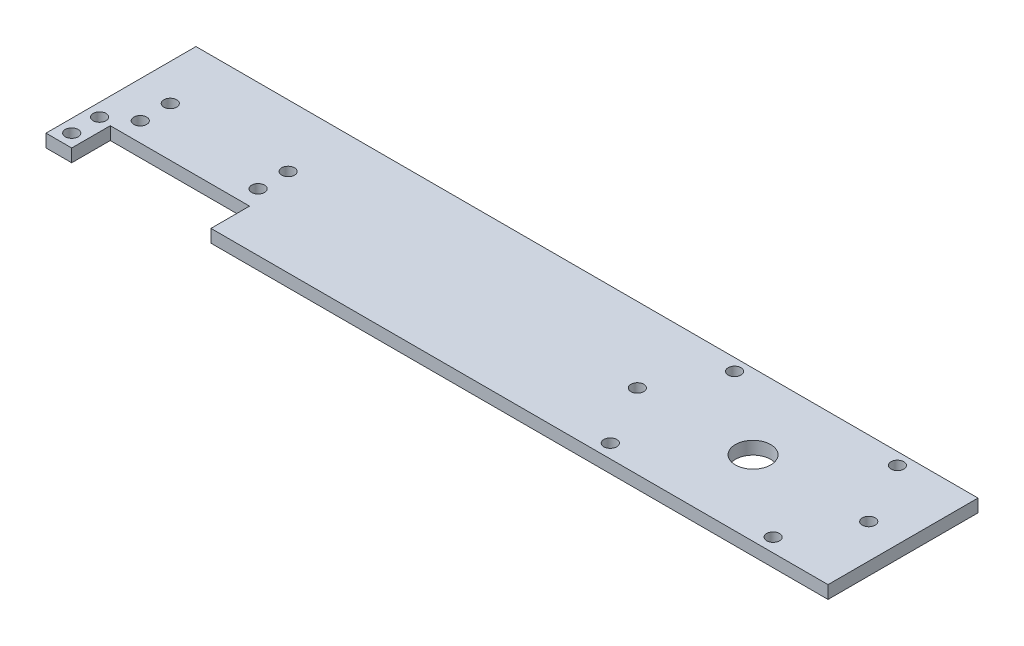
ISO-10303-21;
HEADER;
FILE_DESCRIPTION(('STEP AP214'),'2;1');
FILE_NAME('part.step','',(''),(''),'','','');
FILE_SCHEMA(('AUTOMOTIVE_DESIGN { 1 0 10303 214 1 1 1 1 }'));
ENDSEC;
DATA;
#1=APPLICATION_CONTEXT('core data for automotive mechanical design processes');
#2=APPLICATION_PROTOCOL_DEFINITION('international standard','automotive_design',2000,#1);
#3=PRODUCT_CONTEXT('',#1,'mechanical');
#4=PRODUCT('Part','Part','',(#3));
#5=PRODUCT_RELATED_PRODUCT_CATEGORY('part','',(#4));
#6=PRODUCT_DEFINITION_FORMATION('','',#4);
#7=PRODUCT_DEFINITION_CONTEXT('part definition',#1,'design');
#8=PRODUCT_DEFINITION('design','',#6,#7);
#9=PRODUCT_DEFINITION_SHAPE('','',#8);
#10=(LENGTH_UNIT() NAMED_UNIT(*) SI_UNIT(.MILLI.,.METRE.));
#11=(NAMED_UNIT(*) PLANE_ANGLE_UNIT() SI_UNIT($,.RADIAN.));
#12=(NAMED_UNIT(*) SI_UNIT($,.STERADIAN.) SOLID_ANGLE_UNIT());
#13=UNCERTAINTY_MEASURE_WITH_UNIT(LENGTH_MEASURE(1.E-05),#10,'distance_accuracy_value','');
#14=(GEOMETRIC_REPRESENTATION_CONTEXT(3) GLOBAL_UNCERTAINTY_ASSIGNED_CONTEXT((#13)) GLOBAL_UNIT_ASSIGNED_CONTEXT((#10,
#11,#12)) REPRESENTATION_CONTEXT('',''));
#15=CARTESIAN_POINT('',(0.,0.,0.));
#16=DIRECTION('',(0.,0.,1.));
#17=DIRECTION('',(1.,0.,0.));
#18=AXIS2_PLACEMENT_3D('',#15,#16,#17);
#19=CARTESIAN_POINT('',(0.,3.,12.5));
#20=DIRECTION('',(0.,0.,-1.));
#21=DIRECTION('',(-1.,0.,0.));
#22=AXIS2_PLACEMENT_3D('',#19,#20,#21);
#23=PLANE('',#22);
#24=DIRECTION('',(0.,1.,0.));
#25=VECTOR('',#24,1.);
#26=CARTESIAN_POINT('',(-94.,0.,12.5));
#27=LINE('',#26,#25);
#28=CARTESIAN_POINT('',(-94.,0.,12.5));
#29=VERTEX_POINT('',#28);
#30=CARTESIAN_POINT('',(-94.,3.,12.5));
#31=VERTEX_POINT('',#30);
#32=EDGE_CURVE('E120',#29,#31,#27,.T.);
#33=ORIENTED_EDGE('',*,*,#32,.T.);
#34=DIRECTION('',(1.,0.,0.));
#35=VECTOR('',#34,1.);
#36=CARTESIAN_POINT('',(0.,3.,12.5));
#37=LINE('',#36,#35);
#38=CARTESIAN_POINT('',(-100.,3.,12.5));
#39=VERTEX_POINT('',#38);
#40=EDGE_CURVE('E245',#39,#31,#37,.T.);
#41=ORIENTED_EDGE('',*,*,#40,.F.);
#42=DIRECTION('',(0.,-1.,0.));
#43=VECTOR('',#42,1.);
#44=CARTESIAN_POINT('',(-100.,3.,12.5));
#45=LINE('',#44,#43);
#46=CARTESIAN_POINT('',(-100.,0.,12.5));
#47=VERTEX_POINT('',#46);
#48=EDGE_CURVE('E139',#39,#47,#45,.T.);
#49=ORIENTED_EDGE('',*,*,#48,.T.);
#50=DIRECTION('',(1.,0.,0.));
#51=VECTOR('',#50,1.);
#52=CARTESIAN_POINT('',(0.,0.,12.5));
#53=LINE('',#52,#51);
#54=EDGE_CURVE('E136',#47,#29,#53,.T.);
#55=ORIENTED_EDGE('',*,*,#54,.T.);
#56=EDGE_LOOP('',(#33,#41,#49,#55));
#57=FACE_BOUND('',#56,.T.);
#58=ADVANCED_FACE('F43',(#57),#23,.F.);
#59=CARTESIAN_POINT('',(0.,3.,0.));
#60=DIRECTION('',(0.,1.,0.));
#61=DIRECTION('',(0.,0.,1.));
#62=AXIS2_PLACEMENT_3D('',#59,#60,#61);
#63=PLANE('',#62);
#64=CARTESIAN_POINT('',(28.5,3.,9.30763797671888));
#65=DIRECTION('',(0.,-1.,0.));
#66=DIRECTION('',(0.,0.,-1.));
#67=AXIS2_PLACEMENT_3D('',#64,#65,#66);
#68=CIRCLE('',#67,1.5);
#69=CARTESIAN_POINT('',(28.5,3.,7.80763797671888));
#70=VERTEX_POINT('',#69);
#71=EDGE_CURVE('E512',#70,#70,#68,.T.);
#72=ORIENTED_EDGE('',*,*,#71,.T.);
#73=EDGE_LOOP('',(#72));
#74=FACE_BOUND('',#73,.T.);
#75=CARTESIAN_POINT('',(28.5000000000001,3.,-19.6923620232811));
#76=DIRECTION('',(0.,-1.,0.));
#77=DIRECTION('',(0.,0.,-1.));
#78=AXIS2_PLACEMENT_3D('',#75,#76,#77);
#79=CIRCLE('',#78,1.5);
#80=CARTESIAN_POINT('',(28.5000000000001,3.,-21.1923620232811));
#81=VERTEX_POINT('',#80);
#82=EDGE_CURVE('E514',#81,#81,#79,.T.);
#83=ORIENTED_EDGE('',*,*,#82,.T.);
#84=EDGE_LOOP('',(#83));
#85=FACE_BOUND('',#84,.T.);
#86=CARTESIAN_POINT('',(66.5000000000001,3.,-19.6923620232811));
#87=DIRECTION('',(0.,-1.,0.));
#88=DIRECTION('',(0.,0.,-1.));
#89=AXIS2_PLACEMENT_3D('',#86,#87,#88);
#90=CIRCLE('',#89,1.5);
#91=CARTESIAN_POINT('',(66.5000000000001,3.,-21.1923620232811));
#92=VERTEX_POINT('',#91);
#93=EDGE_CURVE('E518',#92,#92,#90,.T.);
#94=ORIENTED_EDGE('',*,*,#93,.T.);
#95=EDGE_LOOP('',(#94));
#96=FACE_BOUND('',#95,.T.);
#97=CARTESIAN_POINT('',(66.5,3.,9.30763797671825));
#98=DIRECTION('',(0.,-1.,0.));
#99=DIRECTION('',(0.,0.,-1.));
#100=AXIS2_PLACEMENT_3D('',#97,#98,#99);
#101=CIRCLE('',#100,1.49999999999981);
#102=CARTESIAN_POINT('',(66.5,3.,7.80763797671844));
#103=VERTEX_POINT('',#102);
#104=EDGE_CURVE('E215',#103,#103,#101,.T.);
#105=ORIENTED_EDGE('',*,*,#104,.T.);
#106=EDGE_LOOP('',(#105));
#107=FACE_BOUND('',#106,.T.);
#108=CARTESIAN_POINT('',(-91.4999999999999,3.,-1.));
#109=DIRECTION('',(0.,1.,0.));
#110=DIRECTION('',(0.,0.,1.));
#111=AXIS2_PLACEMENT_3D('',#108,#109,#110);
#112=CIRCLE('',#111,1.5);
#113=CARTESIAN_POINT('',(-91.4999999999999,3.,0.499999999999995));
#114=VERTEX_POINT('',#113);
#115=EDGE_CURVE('E258',#114,#114,#112,.T.);
#116=ORIENTED_EDGE('',*,*,#115,.F.);
#117=EDGE_LOOP('',(#116));
#118=FACE_BOUND('',#117,.T.);
#119=CARTESIAN_POINT('',(-63.9999999999999,3.,-1.));
#120=DIRECTION('',(0.,1.,0.));
#121=DIRECTION('',(0.,0.,1.));
#122=AXIS2_PLACEMENT_3D('',#119,#120,#121);
#123=CIRCLE('',#122,1.5);
#124=CARTESIAN_POINT('',(-63.9999999999999,3.,0.499999999999994));
#125=VERTEX_POINT('',#124);
#126=EDGE_CURVE('E262',#125,#125,#123,.T.);
#127=ORIENTED_EDGE('',*,*,#126,.F.);
#128=EDGE_LOOP('',(#127));
#129=FACE_BOUND('',#128,.T.);
#130=CARTESIAN_POINT('',(-64.,3.,-8.));
#131=DIRECTION('',(0.,1.,0.));
#132=DIRECTION('',(0.,0.,1.));
#133=AXIS2_PLACEMENT_3D('',#130,#131,#132);
#134=CIRCLE('',#133,1.5);
#135=CARTESIAN_POINT('',(-64.,3.,-6.5));
#136=VERTEX_POINT('',#135);
#137=EDGE_CURVE('E266',#136,#136,#134,.T.);
#138=ORIENTED_EDGE('',*,*,#137,.F.);
#139=EDGE_LOOP('',(#138));
#140=FACE_BOUND('',#139,.T.);
#141=CARTESIAN_POINT('',(-91.5,3.,-8.));
#142=DIRECTION('',(0.,1.,0.));
#143=DIRECTION('',(0.,0.,1.));
#144=AXIS2_PLACEMENT_3D('',#141,#142,#143);
#145=CIRCLE('',#144,1.5);
#146=CARTESIAN_POINT('',(-91.5,3.,-6.5));
#147=VERTEX_POINT('',#146);
#148=EDGE_CURVE('E270',#147,#147,#145,.T.);
#149=ORIENTED_EDGE('',*,*,#148,.F.);
#150=EDGE_LOOP('',(#149));
#151=FACE_BOUND('',#150,.T.);
#152=CARTESIAN_POINT('',(-97.,3.,3.));
#153=DIRECTION('',(0.,1.,0.));
#154=DIRECTION('',(0.,0.,1.));
#155=AXIS2_PLACEMENT_3D('',#152,#153,#154);
#156=CIRCLE('',#155,1.5);
#157=CARTESIAN_POINT('',(-97.,3.,4.5));
#158=VERTEX_POINT('',#157);
#159=EDGE_CURVE('E274',#158,#158,#156,.T.);
#160=ORIENTED_EDGE('',*,*,#159,.F.);
#161=EDGE_LOOP('',(#160));
#162=FACE_BOUND('',#161,.T.);
#163=CARTESIAN_POINT('',(-97.,3.,9.5));
#164=DIRECTION('',(0.,1.,0.));
#165=DIRECTION('',(0.,0.,1.));
#166=AXIS2_PLACEMENT_3D('',#163,#164,#165);
#167=CIRCLE('',#166,1.5);
#168=CARTESIAN_POINT('',(-97.,3.,11.));
#169=VERTEX_POINT('',#168);
#170=EDGE_CURVE('E278',#169,#169,#167,.T.);
#171=ORIENTED_EDGE('',*,*,#170,.F.);
#172=EDGE_LOOP('',(#171));
#173=FACE_BOUND('',#172,.T.);
#174=CARTESIAN_POINT('',(47.5,3.,-5.));
#175=DIRECTION('',(0.,1.,0.));
#176=DIRECTION('',(0.,0.,1.));
#177=AXIS2_PLACEMENT_3D('',#174,#175,#176);
#178=CIRCLE('',#177,4.125);
#179=CARTESIAN_POINT('',(47.5,3.,-0.875000000000003));
#180=VERTEX_POINT('',#179);
#181=EDGE_CURVE('E282',#180,#180,#178,.T.);
#182=ORIENTED_EDGE('',*,*,#181,.F.);
#183=EDGE_LOOP('',(#182));
#184=FACE_BOUND('',#183,.T.);
#185=CARTESIAN_POINT('',(74.5,3.,-5.));
#186=DIRECTION('',(0.,1.,0.));
#187=DIRECTION('',(0.,0.,1.));
#188=AXIS2_PLACEMENT_3D('',#185,#186,#187);
#189=CIRCLE('',#188,1.5);
#190=CARTESIAN_POINT('',(74.5,3.,-3.5));
#191=VERTEX_POINT('',#190);
#192=EDGE_CURVE('E285',#191,#191,#189,.T.);
#193=ORIENTED_EDGE('',*,*,#192,.F.);
#194=EDGE_LOOP('',(#193));
#195=FACE_BOUND('',#194,.T.);
#196=CARTESIAN_POINT('',(20.5,3.,-4.99999999999999));
#197=DIRECTION('',(0.,1.,0.));
#198=DIRECTION('',(0.,0.,1.));
#199=AXIS2_PLACEMENT_3D('',#196,#197,#198);
#200=CIRCLE('',#199,1.5);
#201=CARTESIAN_POINT('',(20.5,3.,-3.49999999999999));
#202=VERTEX_POINT('',#201);
#203=EDGE_CURVE('E150',#202,#202,#200,.F.);
#204=ORIENTED_EDGE('',*,*,#203,.T.);
#205=EDGE_LOOP('',(#204));
#206=FACE_BOUND('',#205,.T.);
#207=ORIENTED_EDGE('',*,*,#40,.T.);
#208=DIRECTION('',(0.,0.,-1.));
#209=VECTOR('',#208,1.);
#210=CARTESIAN_POINT('',(-94.,3.,0.));
#211=LINE('',#210,#209);
#212=CARTESIAN_POINT('',(-94.,3.,3.5));
#213=VERTEX_POINT('',#212);
#214=EDGE_CURVE('E125',#31,#213,#211,.T.);
#215=ORIENTED_EDGE('',*,*,#214,.T.);
#216=DIRECTION('',(1.,0.,0.));
#217=VECTOR('',#216,1.);
#218=CARTESIAN_POINT('',(0.,3.,3.5));
#219=LINE('',#218,#217);
#220=CARTESIAN_POINT('',(-61.5,3.,3.5));
#221=VERTEX_POINT('',#220);
#222=EDGE_CURVE('E236',#213,#221,#219,.T.);
#223=ORIENTED_EDGE('',*,*,#222,.T.);
#224=DIRECTION('',(0.,0.,-1.));
#225=VECTOR('',#224,1.);
#226=CARTESIAN_POINT('',(-61.5,3.,0.));
#227=LINE('',#226,#225);
#228=CARTESIAN_POINT('',(-61.5,3.,12.5));
#229=VERTEX_POINT('',#228);
#230=EDGE_CURVE('E240',#229,#221,#227,.T.);
#231=ORIENTED_EDGE('',*,*,#230,.F.);
#232=CARTESIAN_POINT('',(82.5,3.,12.5));
#233=VERTEX_POINT('',#232);
#234=EDGE_CURVE('E97',#229,#233,#37,.T.);
#235=ORIENTED_EDGE('',*,*,#234,.T.);
#236=DIRECTION('',(0.,0.,1.));
#237=VECTOR('',#236,1.);
#238=CARTESIAN_POINT('',(82.5,3.,0.));
#239=LINE('',#238,#237);
#240=CARTESIAN_POINT('',(82.5,3.,-22.5));
#241=VERTEX_POINT('',#240);
#242=EDGE_CURVE('E248',#241,#233,#239,.T.);
#243=ORIENTED_EDGE('',*,*,#242,.F.);
#244=DIRECTION('',(1.,0.,0.));
#245=VECTOR('',#244,1.);
#246=CARTESIAN_POINT('',(0.,3.,-22.5));
#247=LINE('',#246,#245);
#248=CARTESIAN_POINT('',(-100.,3.,-22.5));
#249=VERTEX_POINT('',#248);
#250=EDGE_CURVE('E252',#249,#241,#247,.T.);
#251=ORIENTED_EDGE('',*,*,#250,.F.);
#252=DIRECTION('',(0.,0.,1.));
#253=VECTOR('',#252,1.);
#254=CARTESIAN_POINT('',(-100.,3.,0.));
#255=LINE('',#254,#253);
#256=EDGE_CURVE('E69',#249,#39,#255,.T.);
#257=ORIENTED_EDGE('',*,*,#256,.T.);
#258=EDGE_LOOP('',(#207,#215,#223,#231,#235,#243,#251,#257));
#259=FACE_BOUND('',#258,.T.);
#260=ADVANCED_FACE('F294',(#74,#85,#96,#107,#118,#129,#140,#151,#162,#173,#184,#195,#206,#259),
#63,.T.);
#261=CARTESIAN_POINT('',(0.,0.,0.));
#262=DIRECTION('',(0.,1.,0.));
#263=DIRECTION('',(0.,0.,1.));
#264=AXIS2_PLACEMENT_3D('',#261,#262,#263);
#265=PLANE('',#264);
#266=CARTESIAN_POINT('',(28.5,0.,9.30763797671888));
#267=DIRECTION('',(0.,1.,0.));
#268=DIRECTION('',(0.,0.,1.));
#269=AXIS2_PLACEMENT_3D('',#266,#267,#268);
#270=CIRCLE('',#269,1.5);
#271=CARTESIAN_POINT('',(28.5,0.,10.8076379767189));
#272=VERTEX_POINT('',#271);
#273=EDGE_CURVE('E47',#272,#272,#270,.F.);
#274=ORIENTED_EDGE('',*,*,#273,.F.);
#275=EDGE_LOOP('',(#274));
#276=FACE_BOUND('',#275,.T.);
#277=CARTESIAN_POINT('',(28.5000000000001,0.,-19.6923620232811));
#278=DIRECTION('',(0.,1.,0.));
#279=DIRECTION('',(0.,0.,1.));
#280=AXIS2_PLACEMENT_3D('',#277,#278,#279);
#281=CIRCLE('',#280,1.5);
#282=CARTESIAN_POINT('',(28.5000000000001,0.,-18.1923620232811));
#283=VERTEX_POINT('',#282);
#284=EDGE_CURVE('E218',#283,#283,#281,.F.);
#285=ORIENTED_EDGE('',*,*,#284,.F.);
#286=EDGE_LOOP('',(#285));
#287=FACE_BOUND('',#286,.T.);
#288=CARTESIAN_POINT('',(66.5000000000001,0.,-19.6923620232811));
#289=DIRECTION('',(0.,1.,0.));
#290=DIRECTION('',(0.,0.,1.));
#291=AXIS2_PLACEMENT_3D('',#288,#289,#290);
#292=CIRCLE('',#291,1.5);
#293=CARTESIAN_POINT('',(66.5000000000001,0.,-18.1923620232811));
#294=VERTEX_POINT('',#293);
#295=EDGE_CURVE('E214',#294,#294,#292,.F.);
#296=ORIENTED_EDGE('',*,*,#295,.F.);
#297=EDGE_LOOP('',(#296));
#298=FACE_BOUND('',#297,.T.);
#299=CARTESIAN_POINT('',(66.5,0.,9.30763797671825));
#300=DIRECTION('',(0.,1.,0.));
#301=DIRECTION('',(0.,0.,1.));
#302=AXIS2_PLACEMENT_3D('',#299,#300,#301);
#303=CIRCLE('',#302,1.49999999999981);
#304=CARTESIAN_POINT('',(66.5,0.,10.8076379767181));
#305=VERTEX_POINT('',#304);
#306=EDGE_CURVE('E210',#305,#305,#303,.F.);
#307=ORIENTED_EDGE('',*,*,#306,.F.);
#308=EDGE_LOOP('',(#307));
#309=FACE_BOUND('',#308,.T.);
#310=CARTESIAN_POINT('',(20.5,0.,-4.99999999999999));
#311=DIRECTION('',(0.,1.,0.));
#312=DIRECTION('',(0.,0.,1.));
#313=AXIS2_PLACEMENT_3D('',#310,#311,#312);
#314=CIRCLE('',#313,1.5);
#315=CARTESIAN_POINT('',(20.5,0.,-3.49999999999999));
#316=VERTEX_POINT('',#315);
#317=EDGE_CURVE('E190',#316,#316,#314,.F.);
#318=ORIENTED_EDGE('',*,*,#317,.F.);
#319=EDGE_LOOP('',(#318));
#320=FACE_BOUND('',#319,.T.);
#321=CARTESIAN_POINT('',(74.5,0.,-5.));
#322=DIRECTION('',(0.,1.,0.));
#323=DIRECTION('',(0.,0.,1.));
#324=AXIS2_PLACEMENT_3D('',#321,#322,#323);
#325=CIRCLE('',#324,1.5);
#326=CARTESIAN_POINT('',(74.5,0.,-3.5));
#327=VERTEX_POINT('',#326);
#328=EDGE_CURVE('E186',#327,#327,#325,.T.);
#329=ORIENTED_EDGE('',*,*,#328,.T.);
#330=EDGE_LOOP('',(#329));
#331=FACE_BOUND('',#330,.T.);
#332=CARTESIAN_POINT('',(47.5,0.,-5.));
#333=DIRECTION('',(0.,1.,0.));
#334=DIRECTION('',(0.,0.,1.));
#335=AXIS2_PLACEMENT_3D('',#332,#333,#334);
#336=CIRCLE('',#335,4.125);
#337=CARTESIAN_POINT('',(47.5,0.,-0.875000000000003));
#338=VERTEX_POINT('',#337);
#339=EDGE_CURVE('E182',#338,#338,#336,.T.);
#340=ORIENTED_EDGE('',*,*,#339,.T.);
#341=EDGE_LOOP('',(#340));
#342=FACE_BOUND('',#341,.T.);
#343=CARTESIAN_POINT('',(-97.,0.,9.5));
#344=DIRECTION('',(0.,1.,0.));
#345=DIRECTION('',(0.,0.,1.));
#346=AXIS2_PLACEMENT_3D('',#343,#344,#345);
#347=CIRCLE('',#346,1.5);
#348=CARTESIAN_POINT('',(-97.,0.,11.));
#349=VERTEX_POINT('',#348);
#350=EDGE_CURVE('E178',#349,#349,#347,.T.);
#351=ORIENTED_EDGE('',*,*,#350,.T.);
#352=EDGE_LOOP('',(#351));
#353=FACE_BOUND('',#352,.T.);
#354=CARTESIAN_POINT('',(-97.,0.,3.));
#355=DIRECTION('',(0.,1.,0.));
#356=DIRECTION('',(0.,0.,1.));
#357=AXIS2_PLACEMENT_3D('',#354,#355,#356);
#358=CIRCLE('',#357,1.5);
#359=CARTESIAN_POINT('',(-97.,0.,4.5));
#360=VERTEX_POINT('',#359);
#361=EDGE_CURVE('E174',#360,#360,#358,.T.);
#362=ORIENTED_EDGE('',*,*,#361,.T.);
#363=EDGE_LOOP('',(#362));
#364=FACE_BOUND('',#363,.T.);
#365=CARTESIAN_POINT('',(-91.5,0.,-8.));
#366=DIRECTION('',(0.,1.,0.));
#367=DIRECTION('',(0.,0.,1.));
#368=AXIS2_PLACEMENT_3D('',#365,#366,#367);
#369=CIRCLE('',#368,1.5);
#370=CARTESIAN_POINT('',(-91.5,0.,-6.5));
#371=VERTEX_POINT('',#370);
#372=EDGE_CURVE('E170',#371,#371,#369,.T.);
#373=ORIENTED_EDGE('',*,*,#372,.T.);
#374=EDGE_LOOP('',(#373));
#375=FACE_BOUND('',#374,.T.);
#376=CARTESIAN_POINT('',(-64.,0.,-8.));
#377=DIRECTION('',(0.,1.,0.));
#378=DIRECTION('',(0.,0.,1.));
#379=AXIS2_PLACEMENT_3D('',#376,#377,#378);
#380=CIRCLE('',#379,1.5);
#381=CARTESIAN_POINT('',(-64.,0.,-6.5));
#382=VERTEX_POINT('',#381);
#383=EDGE_CURVE('E166',#382,#382,#380,.T.);
#384=ORIENTED_EDGE('',*,*,#383,.T.);
#385=EDGE_LOOP('',(#384));
#386=FACE_BOUND('',#385,.T.);
#387=CARTESIAN_POINT('',(-63.9999999999999,0.,-1.));
#388=DIRECTION('',(0.,1.,0.));
#389=DIRECTION('',(0.,0.,1.));
#390=AXIS2_PLACEMENT_3D('',#387,#388,#389);
#391=CIRCLE('',#390,1.5);
#392=CARTESIAN_POINT('',(-63.9999999999999,0.,0.499999999999994));
#393=VERTEX_POINT('',#392);
#394=EDGE_CURVE('E162',#393,#393,#391,.T.);
#395=ORIENTED_EDGE('',*,*,#394,.T.);
#396=EDGE_LOOP('',(#395));
#397=FACE_BOUND('',#396,.T.);
#398=CARTESIAN_POINT('',(-91.4999999999999,0.,-1.));
#399=DIRECTION('',(0.,1.,0.));
#400=DIRECTION('',(0.,0.,1.));
#401=AXIS2_PLACEMENT_3D('',#398,#399,#400);
#402=CIRCLE('',#401,1.5);
#403=CARTESIAN_POINT('',(-91.4999999999999,0.,0.499999999999995));
#404=VERTEX_POINT('',#403);
#405=EDGE_CURVE('E158',#404,#404,#402,.T.);
#406=ORIENTED_EDGE('',*,*,#405,.T.);
#407=EDGE_LOOP('',(#406));
#408=FACE_BOUND('',#407,.T.);
#409=DIRECTION('',(0.,0.,-1.));
#410=VECTOR('',#409,1.);
#411=CARTESIAN_POINT('',(-94.,0.,0.));
#412=LINE('',#411,#410);
#413=CARTESIAN_POINT('',(-94.,0.,3.5));
#414=VERTEX_POINT('',#413);
#415=EDGE_CURVE('E11',#29,#414,#412,.T.);
#416=ORIENTED_EDGE('',*,*,#415,.F.);
#417=ORIENTED_EDGE('',*,*,#54,.F.);
#418=DIRECTION('',(0.,0.,1.));
#419=VECTOR('',#418,1.);
#420=CARTESIAN_POINT('',(-100.,0.,0.));
#421=LINE('',#420,#419);
#422=CARTESIAN_POINT('',(-100.,0.,-22.5));
#423=VERTEX_POINT('',#422);
#424=EDGE_CURVE('E90',#423,#47,#421,.T.);
#425=ORIENTED_EDGE('',*,*,#424,.F.);
#426=DIRECTION('',(1.,0.,0.));
#427=VECTOR('',#426,1.);
#428=CARTESIAN_POINT('',(0.,0.,-22.5));
#429=LINE('',#428,#427);
#430=CARTESIAN_POINT('',(82.5,0.,-22.5));
#431=VERTEX_POINT('',#430);
#432=EDGE_CURVE('E147',#423,#431,#429,.T.);
#433=ORIENTED_EDGE('',*,*,#432,.T.);
#434=DIRECTION('',(0.,0.,1.));
#435=VECTOR('',#434,1.);
#436=CARTESIAN_POINT('',(82.5,0.,0.));
#437=LINE('',#436,#435);
#438=CARTESIAN_POINT('',(82.5,0.,12.5));
#439=VERTEX_POINT('',#438);
#440=EDGE_CURVE('E141',#431,#439,#437,.T.);
#441=ORIENTED_EDGE('',*,*,#440,.T.);
#442=CARTESIAN_POINT('',(-61.5,0.,12.5));
#443=VERTEX_POINT('',#442);
#444=EDGE_CURVE('E142',#443,#439,#53,.T.);
#445=ORIENTED_EDGE('',*,*,#444,.F.);
#446=DIRECTION('',(0.,0.,-1.));
#447=VECTOR('',#446,1.);
#448=CARTESIAN_POINT('',(-61.5,0.,0.));
#449=LINE('',#448,#447);
#450=CARTESIAN_POINT('',(-61.5,0.,3.5));
#451=VERTEX_POINT('',#450);
#452=EDGE_CURVE('E53',#443,#451,#449,.T.);
#453=ORIENTED_EDGE('',*,*,#452,.T.);
#454=DIRECTION('',(1.,0.,0.));
#455=VECTOR('',#454,1.);
#456=CARTESIAN_POINT('',(0.,0.,3.5));
#457=LINE('',#456,#455);
#458=EDGE_CURVE('E138',#414,#451,#457,.T.);
#459=ORIENTED_EDGE('',*,*,#458,.F.);
#460=EDGE_LOOP('',(#416,#417,#425,#433,#441,#445,#453,#459));
#461=FACE_BOUND('',#460,.T.);
#462=ADVANCED_FACE('F135',(#276,#287,#298,#309,#320,#331,#342,#353,#364,#375,#386,#397,#408,
#461),#265,.F.);
#463=ORIENTED_EDGE('',*,*,#234,.F.);
#464=DIRECTION('',(0.,1.,0.));
#465=VECTOR('',#464,1.);
#466=CARTESIAN_POINT('',(-61.5,0.,12.5));
#467=LINE('',#466,#465);
#468=EDGE_CURVE('E130',#443,#229,#467,.T.);
#469=ORIENTED_EDGE('',*,*,#468,.F.);
#470=ORIENTED_EDGE('',*,*,#444,.T.);
#471=DIRECTION('',(0.,-1.,0.));
#472=VECTOR('',#471,1.);
#473=CARTESIAN_POINT('',(82.5,3.,12.5));
#474=LINE('',#473,#472);
#475=EDGE_CURVE('E202',#233,#439,#474,.T.);
#476=ORIENTED_EDGE('',*,*,#475,.F.);
#477=EDGE_LOOP('',(#463,#469,#470,#476));
#478=FACE_BOUND('',#477,.T.);
#479=ADVANCED_FACE('F45',(#478),#23,.F.);
#480=CARTESIAN_POINT('',(82.5,3.,0.));
#481=DIRECTION('',(1.,0.,0.));
#482=DIRECTION('',(0.,0.,-1.));
#483=AXIS2_PLACEMENT_3D('',#480,#481,#482);
#484=PLANE('',#483);
#485=ORIENTED_EDGE('',*,*,#440,.F.);
#486=DIRECTION('',(0.,-1.,0.));
#487=VECTOR('',#486,1.);
#488=CARTESIAN_POINT('',(82.5,3.,-22.5));
#489=LINE('',#488,#487);
#490=EDGE_CURVE('E199',#241,#431,#489,.T.);
#491=ORIENTED_EDGE('',*,*,#490,.F.);
#492=ORIENTED_EDGE('',*,*,#242,.T.);
#493=ORIENTED_EDGE('',*,*,#475,.T.);
#494=EDGE_LOOP('',(#485,#491,#492,#493));
#495=FACE_BOUND('',#494,.T.);
#496=ADVANCED_FACE('F344',(#495),#484,.T.);
#497=CARTESIAN_POINT('',(0.,3.,-22.5));
#498=DIRECTION('',(0.,0.,-1.));
#499=DIRECTION('',(-1.,0.,0.));
#500=AXIS2_PLACEMENT_3D('',#497,#498,#499);
#501=PLANE('',#500);
#502=ORIENTED_EDGE('',*,*,#432,.F.);
#503=DIRECTION('',(0.,-1.,0.));
#504=VECTOR('',#503,1.);
#505=CARTESIAN_POINT('',(-100.,3.,-22.5));
#506=LINE('',#505,#504);
#507=EDGE_CURVE('E196',#249,#423,#506,.T.);
#508=ORIENTED_EDGE('',*,*,#507,.F.);
#509=ORIENTED_EDGE('',*,*,#250,.T.);
#510=ORIENTED_EDGE('',*,*,#490,.T.);
#511=EDGE_LOOP('',(#502,#508,#509,#510));
#512=FACE_BOUND('',#511,.T.);
#513=ADVANCED_FACE('F350',(#512),#501,.T.);
#514=CARTESIAN_POINT('',(74.5,3.,-5.));
#515=DIRECTION('',(0.,-1.,0.));
#516=DIRECTION('',(0.,0.,-1.));
#517=AXIS2_PLACEMENT_3D('',#514,#515,#516);
#518=CYLINDRICAL_SURFACE('',#517,1.5);
#519=ORIENTED_EDGE('',*,*,#192,.T.);
#520=EDGE_LOOP('',(#519));
#521=FACE_BOUND('',#520,.T.);
#522=ORIENTED_EDGE('',*,*,#328,.F.);
#523=EDGE_LOOP('',(#522));
#524=FACE_BOUND('',#523,.T.);
#525=ADVANCED_FACE('F373',(#521,#524),#518,.F.);
#526=CARTESIAN_POINT('',(47.5,3.,-5.));
#527=DIRECTION('',(0.,-1.,0.));
#528=DIRECTION('',(0.,0.,-1.));
#529=AXIS2_PLACEMENT_3D('',#526,#527,#528);
#530=CYLINDRICAL_SURFACE('',#529,4.125);
#531=ORIENTED_EDGE('',*,*,#181,.T.);
#532=EDGE_LOOP('',(#531));
#533=FACE_BOUND('',#532,.T.);
#534=ORIENTED_EDGE('',*,*,#339,.F.);
#535=EDGE_LOOP('',(#534));
#536=FACE_BOUND('',#535,.T.);
#537=ADVANCED_FACE('F376',(#533,#536),#530,.F.);
#538=CARTESIAN_POINT('',(-97.,3.,9.5));
#539=DIRECTION('',(0.,-1.,0.));
#540=DIRECTION('',(0.,0.,-1.));
#541=AXIS2_PLACEMENT_3D('',#538,#539,#540);
#542=CYLINDRICAL_SURFACE('',#541,1.5);
#543=ORIENTED_EDGE('',*,*,#170,.T.);
#544=EDGE_LOOP('',(#543));
#545=FACE_BOUND('',#544,.T.);
#546=ORIENTED_EDGE('',*,*,#350,.F.);
#547=EDGE_LOOP('',(#546));
#548=FACE_BOUND('',#547,.T.);
#549=ADVANCED_FACE('F379',(#545,#548),#542,.F.);
#550=CARTESIAN_POINT('',(-97.,3.,3.));
#551=DIRECTION('',(0.,-1.,0.));
#552=DIRECTION('',(0.,0.,-1.));
#553=AXIS2_PLACEMENT_3D('',#550,#551,#552);
#554=CYLINDRICAL_SURFACE('',#553,1.5);
#555=ORIENTED_EDGE('',*,*,#159,.T.);
#556=EDGE_LOOP('',(#555));
#557=FACE_BOUND('',#556,.T.);
#558=ORIENTED_EDGE('',*,*,#361,.F.);
#559=EDGE_LOOP('',(#558));
#560=FACE_BOUND('',#559,.T.);
#561=ADVANCED_FACE('F383',(#557,#560),#554,.F.);
#562=CARTESIAN_POINT('',(-91.5,3.,-8.));
#563=DIRECTION('',(0.,-1.,0.));
#564=DIRECTION('',(0.,0.,-1.));
#565=AXIS2_PLACEMENT_3D('',#562,#563,#564);
#566=CYLINDRICAL_SURFACE('',#565,1.5);
#567=ORIENTED_EDGE('',*,*,#148,.T.);
#568=EDGE_LOOP('',(#567));
#569=FACE_BOUND('',#568,.T.);
#570=ORIENTED_EDGE('',*,*,#372,.F.);
#571=EDGE_LOOP('',(#570));
#572=FACE_BOUND('',#571,.T.);
#573=ADVANCED_FACE('F387',(#569,#572),#566,.F.);
#574=CARTESIAN_POINT('',(-64.,3.,-8.));
#575=DIRECTION('',(0.,-1.,0.));
#576=DIRECTION('',(0.,0.,-1.));
#577=AXIS2_PLACEMENT_3D('',#574,#575,#576);
#578=CYLINDRICAL_SURFACE('',#577,1.5);
#579=ORIENTED_EDGE('',*,*,#137,.T.);
#580=EDGE_LOOP('',(#579));
#581=FACE_BOUND('',#580,.T.);
#582=ORIENTED_EDGE('',*,*,#383,.F.);
#583=EDGE_LOOP('',(#582));
#584=FACE_BOUND('',#583,.T.);
#585=ADVANCED_FACE('F333',(#581,#584),#578,.F.);
#586=CARTESIAN_POINT('',(-63.9999999999999,3.,-1.));
#587=DIRECTION('',(0.,-1.,0.));
#588=DIRECTION('',(0.,0.,-1.));
#589=AXIS2_PLACEMENT_3D('',#586,#587,#588);
#590=CYLINDRICAL_SURFACE('',#589,1.5);
#591=ORIENTED_EDGE('',*,*,#126,.T.);
#592=EDGE_LOOP('',(#591));
#593=FACE_BOUND('',#592,.T.);
#594=ORIENTED_EDGE('',*,*,#394,.F.);
#595=EDGE_LOOP('',(#594));
#596=FACE_BOUND('',#595,.T.);
#597=ADVANCED_FACE('F325',(#593,#596),#590,.F.);
#598=CARTESIAN_POINT('',(-91.4999999999999,3.,-1.));
#599=DIRECTION('',(0.,-1.,0.));
#600=DIRECTION('',(0.,0.,-1.));
#601=AXIS2_PLACEMENT_3D('',#598,#599,#600);
#602=CYLINDRICAL_SURFACE('',#601,1.5);
#603=ORIENTED_EDGE('',*,*,#115,.T.);
#604=EDGE_LOOP('',(#603));
#605=FACE_BOUND('',#604,.T.);
#606=ORIENTED_EDGE('',*,*,#405,.F.);
#607=EDGE_LOOP('',(#606));
#608=FACE_BOUND('',#607,.T.);
#609=ADVANCED_FACE('F323',(#605,#608),#602,.F.);
#610=CARTESIAN_POINT('',(-100.,3.,0.));
#611=DIRECTION('',(1.,0.,0.));
#612=DIRECTION('',(0.,0.,-1.));
#613=AXIS2_PLACEMENT_3D('',#610,#611,#612);
#614=PLANE('',#613);
#615=ORIENTED_EDGE('',*,*,#424,.T.);
#616=ORIENTED_EDGE('',*,*,#48,.F.);
#617=ORIENTED_EDGE('',*,*,#256,.F.);
#618=ORIENTED_EDGE('',*,*,#507,.T.);
#619=EDGE_LOOP('',(#615,#616,#617,#618));
#620=FACE_BOUND('',#619,.T.);
#621=ADVANCED_FACE('F299',(#620),#614,.F.);
#622=CARTESIAN_POINT('',(20.5,3.,-4.99999999999999));
#623=DIRECTION('',(0.,-1.,0.));
#624=DIRECTION('',(0.,0.,-1.));
#625=AXIS2_PLACEMENT_3D('',#622,#623,#624);
#626=CYLINDRICAL_SURFACE('',#625,1.5);
#627=ORIENTED_EDGE('',*,*,#203,.F.);
#628=EDGE_LOOP('',(#627));
#629=FACE_BOUND('',#628,.T.);
#630=ORIENTED_EDGE('',*,*,#317,.T.);
#631=EDGE_LOOP('',(#630));
#632=FACE_BOUND('',#631,.T.);
#633=ADVANCED_FACE('F296',(#629,#632),#626,.F.);
#634=CARTESIAN_POINT('',(-94.,0.,46.4737806416799));
#635=DIRECTION('',(1.,0.,0.));
#636=DIRECTION('',(0.,0.,-1.));
#637=AXIS2_PLACEMENT_3D('',#634,#635,#636);
#638=PLANE('',#637);
#639=ORIENTED_EDGE('',*,*,#32,.F.);
#640=ORIENTED_EDGE('',*,*,#415,.T.);
#641=DIRECTION('',(0.,-1.,0.));
#642=VECTOR('',#641,1.);
#643=CARTESIAN_POINT('',(-94.,0.,3.5));
#644=LINE('',#643,#642);
#645=EDGE_CURVE('E61',#213,#414,#644,.T.);
#646=ORIENTED_EDGE('',*,*,#645,.F.);
#647=ORIENTED_EDGE('',*,*,#214,.F.);
#648=EDGE_LOOP('',(#639,#640,#646,#647));
#649=FACE_BOUND('',#648,.T.);
#650=ADVANCED_FACE('F122',(#649),#638,.T.);
#651=CARTESIAN_POINT('',(-61.5,0.,46.4737806416799));
#652=DIRECTION('',(1.,0.,0.));
#653=DIRECTION('',(0.,0.,-1.));
#654=AXIS2_PLACEMENT_3D('',#651,#652,#653);
#655=PLANE('',#654);
#656=ORIENTED_EDGE('',*,*,#230,.T.);
#657=DIRECTION('',(0.,-1.,0.));
#658=VECTOR('',#657,1.);
#659=CARTESIAN_POINT('',(-61.5,0.,3.5));
#660=LINE('',#659,#658);
#661=EDGE_CURVE('E131',#221,#451,#660,.T.);
#662=ORIENTED_EDGE('',*,*,#661,.T.);
#663=ORIENTED_EDGE('',*,*,#452,.F.);
#664=ORIENTED_EDGE('',*,*,#468,.T.);
#665=EDGE_LOOP('',(#656,#662,#663,#664));
#666=FACE_BOUND('',#665,.T.);
#667=ADVANCED_FACE('F361',(#666),#655,.F.);
#668=CARTESIAN_POINT('',(0.,0.,3.5));
#669=DIRECTION('',(0.,0.,1.));
#670=DIRECTION('',(1.,0.,0.));
#671=AXIS2_PLACEMENT_3D('',#668,#669,#670);
#672=PLANE('',#671);
#673=ORIENTED_EDGE('',*,*,#645,.T.);
#674=ORIENTED_EDGE('',*,*,#458,.T.);
#675=ORIENTED_EDGE('',*,*,#661,.F.);
#676=ORIENTED_EDGE('',*,*,#222,.F.);
#677=EDGE_LOOP('',(#673,#674,#675,#676));
#678=FACE_BOUND('',#677,.T.);
#679=ADVANCED_FACE('F359',(#678),#672,.T.);
#680=CARTESIAN_POINT('',(66.5,-7.,9.30763797671825));
#681=DIRECTION('',(0.,1.,0.));
#682=DIRECTION('',(0.,0.,1.));
#683=AXIS2_PLACEMENT_3D('',#680,#681,#682);
#684=CYLINDRICAL_SURFACE('',#683,1.49999999999981);
#685=ORIENTED_EDGE('',*,*,#104,.F.);
#686=EDGE_LOOP('',(#685));
#687=FACE_BOUND('',#686,.T.);
#688=ORIENTED_EDGE('',*,*,#306,.T.);
#689=EDGE_LOOP('',(#688));
#690=FACE_BOUND('',#689,.T.);
#691=ADVANCED_FACE('F368',(#687,#690),#684,.F.);
#692=CARTESIAN_POINT('',(66.5000000000001,-7.,-19.6923620232811));
#693=DIRECTION('',(0.,1.,0.));
#694=DIRECTION('',(0.,0.,1.));
#695=AXIS2_PLACEMENT_3D('',#692,#693,#694);
#696=CYLINDRICAL_SURFACE('',#695,1.5);
#697=ORIENTED_EDGE('',*,*,#93,.F.);
#698=EDGE_LOOP('',(#697));
#699=FACE_BOUND('',#698,.T.);
#700=ORIENTED_EDGE('',*,*,#295,.T.);
#701=EDGE_LOOP('',(#700));
#702=FACE_BOUND('',#701,.T.);
#703=ADVANCED_FACE('F477',(#699,#702),#696,.F.);
#704=CARTESIAN_POINT('',(28.5000000000001,-7.,-19.6923620232811));
#705=DIRECTION('',(0.,1.,0.));
#706=DIRECTION('',(0.,0.,1.));
#707=AXIS2_PLACEMENT_3D('',#704,#705,#706);
#708=CYLINDRICAL_SURFACE('',#707,1.5);
#709=ORIENTED_EDGE('',*,*,#82,.F.);
#710=EDGE_LOOP('',(#709));
#711=FACE_BOUND('',#710,.T.);
#712=ORIENTED_EDGE('',*,*,#284,.T.);
#713=EDGE_LOOP('',(#712));
#714=FACE_BOUND('',#713,.T.);
#715=ADVANCED_FACE('F486',(#711,#714),#708,.F.);
#716=CARTESIAN_POINT('',(28.5,-7.,9.30763797671888));
#717=DIRECTION('',(0.,1.,0.));
#718=DIRECTION('',(0.,0.,1.));
#719=AXIS2_PLACEMENT_3D('',#716,#717,#718);
#720=CYLINDRICAL_SURFACE('',#719,1.5);
#721=ORIENTED_EDGE('',*,*,#71,.F.);
#722=EDGE_LOOP('',(#721));
#723=FACE_BOUND('',#722,.T.);
#724=ORIENTED_EDGE('',*,*,#273,.T.);
#725=EDGE_LOOP('',(#724));
#726=FACE_BOUND('',#725,.T.);
#727=ADVANCED_FACE('F496',(#723,#726),#720,.F.);
#728=CLOSED_SHELL('',(#58,#260,#462,#479,#496,#513,#525,#537,#549,#561,#573,#585,#597,#609,#621,
#633,#650,#667,#679,#691,#703,#715,#727));
#729=MANIFOLD_SOLID_BREP('B2',#728);
#730=ADVANCED_BREP_SHAPE_REPRESENTATION('',(#18,#729),#14);
#731=SHAPE_DEFINITION_REPRESENTATION(#9,#730);
ENDSEC;
END-ISO-10303-21;
